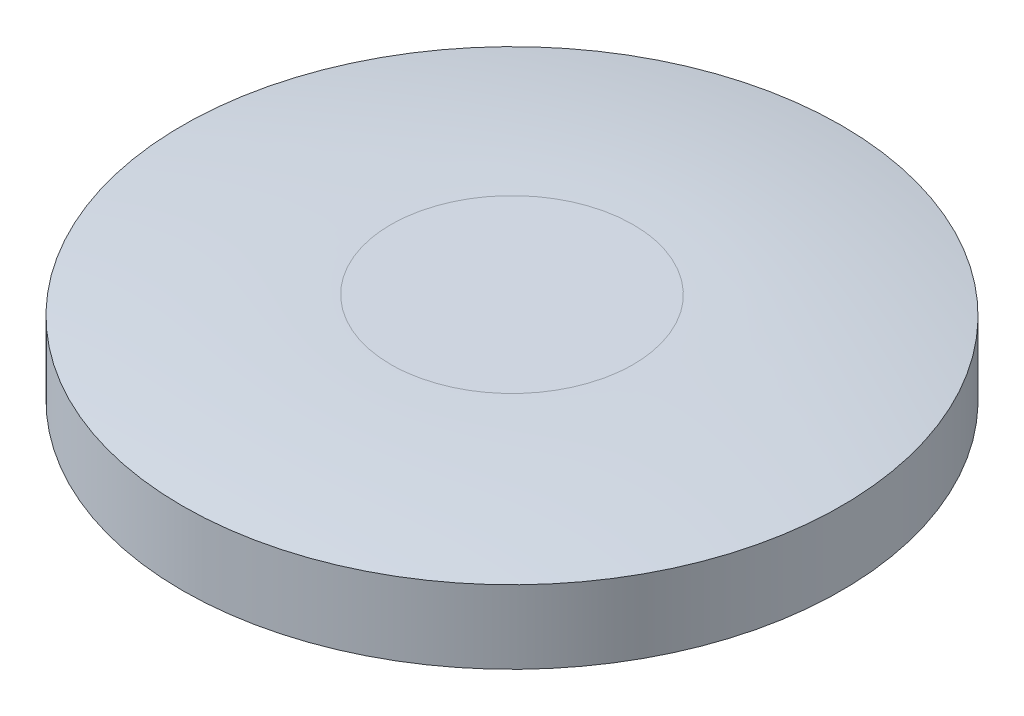
ISO-10303-21;
HEADER;
FILE_DESCRIPTION(('STEP AP214'),'2;1');
FILE_NAME('part.step','',(''),(''),'','','');
FILE_SCHEMA(('AUTOMOTIVE_DESIGN { 1 0 10303 214 1 1 1 1 }'));
ENDSEC;
DATA;
#1=APPLICATION_CONTEXT('core data for automotive mechanical design processes');
#2=APPLICATION_PROTOCOL_DEFINITION('international standard','automotive_design',2000,#1);
#3=PRODUCT_CONTEXT('',#1,'mechanical');
#4=PRODUCT('Part','Part','',(#3));
#5=PRODUCT_RELATED_PRODUCT_CATEGORY('part','',(#4));
#6=PRODUCT_DEFINITION_FORMATION('','',#4);
#7=PRODUCT_DEFINITION_CONTEXT('part definition',#1,'design');
#8=PRODUCT_DEFINITION('design','',#6,#7);
#9=PRODUCT_DEFINITION_SHAPE('','',#8);
#10=(LENGTH_UNIT() NAMED_UNIT(*) SI_UNIT(.MILLI.,.METRE.));
#11=(NAMED_UNIT(*) PLANE_ANGLE_UNIT() SI_UNIT($,.RADIAN.));
#12=(NAMED_UNIT(*) SI_UNIT($,.STERADIAN.) SOLID_ANGLE_UNIT());
#13=UNCERTAINTY_MEASURE_WITH_UNIT(LENGTH_MEASURE(1.E-05),#10,'distance_accuracy_value','');
#14=(GEOMETRIC_REPRESENTATION_CONTEXT(3) GLOBAL_UNCERTAINTY_ASSIGNED_CONTEXT((#13)) GLOBAL_UNIT_ASSIGNED_CONTEXT((#10,
#11,#12)) REPRESENTATION_CONTEXT('',''));
#15=CARTESIAN_POINT('',(0.,0.,0.));
#16=DIRECTION('',(0.,0.,1.));
#17=DIRECTION('',(1.,0.,0.));
#18=AXIS2_PLACEMENT_3D('',#15,#16,#17);
#19=CARTESIAN_POINT('',(0.,2.5,0.));
#20=DIRECTION('',(0.,1.,0.));
#21=DIRECTION('',(0.,0.,1.));
#22=AXIS2_PLACEMENT_3D('',#19,#20,#21);
#23=PLANE('',#22);
#24=CARTESIAN_POINT('',(-3.30895580666,2.49999999999977,0.));
#25=CARTESIAN_POINT('',(-3.30893733865203,2.49999999994382,-0.0594361078107856));
#26=CARTESIAN_POINT('',(-3.30733505503147,2.49999999998868,-0.118870390266973));
#27=CARTESIAN_POINT('',(-3.30097116644436,2.50000000001085,-0.237570616157456));
#28=CARTESIAN_POINT('',(-3.29620950593508,2.49999999998817,-0.296836556613857));
#29=CARTESIAN_POINT('',(-3.28353484144066,2.49999999960607,-0.415036416418897));
#30=CARTESIAN_POINT('',(-3.27562167175231,2.49999999924664,-0.473970318144007));
#31=CARTESIAN_POINT('',(-3.26141752296529,2.49999999765339,-0.561990217652563));
#32=CARTESIAN_POINT('',(-3.25629326947035,2.49999999694652,-0.591268871913185));
#33=CARTESIAN_POINT('',(-3.24525892157262,2.49999999534023,-0.649640376034052));
#34=CARTESIAN_POINT('',(-3.23934981149683,2.49999999444104,-0.678733411556944));
#35=CARTESIAN_POINT('',(-3.22040825368625,2.49999999237356,-0.765748635727406));
#36=CARTESIAN_POINT('',(-3.20616100467621,2.49999999183516,-0.823410529368299));
#37=CARTESIAN_POINT('',(-3.17453550496277,2.49999999298747,-0.9378671507964));
#38=CARTESIAN_POINT('',(-3.15715732214068,2.49999999467813,-0.994661897355141));
#39=CARTESIAN_POINT('',(-3.11915901064589,2.49999999793677,-1.10714788637597));
#40=CARTESIAN_POINT('',(-3.09853921691827,2.49999999950477,-1.16283924217911));
#41=CARTESIAN_POINT('',(-3.06102031229192,2.50000000035237,-1.25730917584845));
#42=CARTESIAN_POINT('',(-3.04475711288576,2.5000000001605,-1.29634461127523));
#43=CARTESIAN_POINT('',(-2.99919216657237,2.49999999952022,-1.40007596764891));
#44=CARTESIAN_POINT('',(-2.96853772142963,2.49999999898611,-1.46419094428458));
#45=CARTESIAN_POINT('',(-2.9273016999455,2.49999999731244,-1.54376873921371));
#46=CARTESIAN_POINT('',(-2.91859608309526,2.49999999691027,-1.56022801418134));
#47=CARTESIAN_POINT('',(-2.87850377741433,2.49999999503105,-1.63448856614067));
#48=CARTESIAN_POINT('',(-2.84550435444089,2.49999999341088,-1.69143948527397));
#49=CARTESIAN_POINT('',(-2.79622126903994,2.49999999215405,-1.7708301041527));
#50=CARTESIAN_POINT('',(-2.78132922872477,2.49999999191205,-1.79414885803792));
#51=CARTESIAN_POINT('',(-2.74848088876293,2.4999999917113,-1.84416529528064));
#52=CARTESIAN_POINT('',(-2.73042051009512,2.4999999918051,-1.87079482846359));
#53=CARTESIAN_POINT('',(-2.67507333060766,2.49999999239217,-1.949863379741));
#54=CARTESIAN_POINT('',(-2.63661628487179,2.49999999319109,-2.00148917613588));
#55=CARTESIAN_POINT('',(-2.5567477772561,2.4999999954059,-2.10239608593971));
#56=CARTESIAN_POINT('',(-2.51533647144942,2.49999999682176,-2.15167732298245));
#57=CARTESIAN_POINT('',(-2.429614115738,2.49999999900173,-2.24763981998017));
#58=CARTESIAN_POINT('',(-2.38530333041467,2.49999999976589,-2.29432131644737));
#59=CARTESIAN_POINT('',(-2.30860093215513,2.50000000015999,-2.37093193149955));
#60=CARTESIAN_POINT('',(-2.27685005516299,2.50000000007133,-2.40150723464606));
#61=CARTESIAN_POINT('',(-2.22194675834188,2.49999999978607,-2.45231954515312));
#62=CARTESIAN_POINT('',(-2.19909913217548,2.49999999963025,-2.47288573015193));
#63=CARTESIAN_POINT('',(-2.14701098317918,2.49999999897834,-2.5184853642004));
#64=CARTESIAN_POINT('',(-2.11761138693254,2.49999999840635,-2.54333735349956));
#65=CARTESIAN_POINT('',(-2.05297025626744,2.4999999968344,-2.59606710041674));
#66=CARTESIAN_POINT('',(-2.0175741036473,2.49999999577885,-2.62375565931932));
#67=CARTESIAN_POINT('',(-1.95003118781005,2.49999999392444,-2.67437975527825));
#68=CARTESIAN_POINT('',(-1.91801108072085,2.49999999310999,-2.6974844333635));
#69=CARTESIAN_POINT('',(-1.8628601882547,2.49999999220046,-2.73576850977486));
#70=CARTESIAN_POINT('',(-1.83993832050156,2.499999991963,-2.75124957542508));
#71=CARTESIAN_POINT('',(-1.78993361122691,2.49999999176525,-2.78410022306213));
#72=CARTESIAN_POINT('',(-1.76278233919079,2.49999999185652,-2.80136555692818));
#73=CARTESIAN_POINT('',(-1.68058480407873,2.49999999244148,-2.85194870699837));
#74=CARTESIAN_POINT('',(-1.62478825804121,2.49999999324628,-2.88405826478697));
#75=CARTESIAN_POINT('',(-1.51140734533203,2.49999999542206,-2.94493230343322));
#76=CARTESIAN_POINT('',(-1.45382307289224,2.49999999679301,-2.9736969602241));
#77=CARTESIAN_POINT('',(-1.33705506721513,2.49999999905639,-3.02776089943492));
#78=CARTESIAN_POINT('',(-1.27787147975118,2.49999999994886,-3.05306049641893));
#79=CARTESIAN_POINT('',(-1.1627189844855,2.50000000004679,-3.0983962125339));
#80=CARTESIAN_POINT('',(-1.10684980349366,2.49999999937589,-3.11868675890881));
#81=CARTESIAN_POINT('',(-0.994140040810346,2.49999999883155,-3.1563585747018));
#82=CARTESIAN_POINT('',(-0.937299484840892,2.49999999895808,-3.17373992102438));
#83=CARTESIAN_POINT('',(-0.822774979920826,2.50000000016306,-3.2054771077973));
#84=CARTESIAN_POINT('',(-0.76509097080715,2.50000000124158,-3.21983273128755));
#85=CARTESIAN_POINT('',(-0.678084310824992,2.49999999829089,-3.23920506605898));
#86=CARTESIAN_POINT('',(-0.648999052060136,2.4999999965455,-3.24530282899091));
#87=CARTESIAN_POINT('',(-0.606979501942218,2.49999999534832,-3.25339884486299));
#88=CARTESIAN_POINT('',(-0.594119417620336,2.49999999515951,-3.25578096189621));
#89=CARTESIAN_POINT('',(-0.546897089539505,2.4999999948985,-3.26421644358555));
#90=CARTESIAN_POINT('',(-0.512444698879037,2.49999999554596,-3.26976670129956));
#91=CARTESIAN_POINT('',(-0.422990995880729,2.49999999706043,-3.28272578188041));
#92=CARTESIAN_POINT('',(-0.367865940149489,2.4999999978314,-3.28929742386362));
#93=CARTESIAN_POINT('',(-0.280643385826698,2.49999999883414,-3.29746832721747));
#94=CARTESIAN_POINT('',(-0.248629501353683,2.49999999915622,-3.29999600887208));
#95=CARTESIAN_POINT('',(-0.189848565208276,2.49999999958993,-3.30378118109388));
#96=CARTESIAN_POINT('',(-0.16309059108994,2.49999999972757,-3.30517969978497));
#97=CARTESIAN_POINT('',(-0.0909055542510438,2.49999999997265,-3.30808048260152));
#98=CARTESIAN_POINT('',(-0.0454532615067524,2.49999999999232,-3.30897684753881));
#99=CARTESIAN_POINT('',(0.0593493084427673,2.50000000000949,-3.30892833312862));
#100=CARTESIAN_POINT('',(0.118700268537446,2.49999999999837,-3.30733676609594));
#101=CARTESIAN_POINT('',(0.23722900637213,2.49999999998555,-3.3009512898458));
#102=CARTESIAN_POINT('',(0.296406784976314,2.49999999998384,-3.2961573966355));
#103=CARTESIAN_POINT('',(0.414419713089004,2.49999999998225,-3.28340225777147));
#104=CARTESIAN_POINT('',(0.473254863055518,2.49999999998237,-3.27544101635268));
#105=CARTESIAN_POINT('',(0.59041286264643,2.49999999998694,-3.25636835928678));
#106=CARTESIAN_POINT('',(0.648735711079678,2.49999999999138,-3.24525693631718));
#107=CARTESIAN_POINT('',(0.764699733641788,2.49999999999858,-3.2199179650982));
#108=CARTESIAN_POINT('',(0.822340903688053,2.50000000000134,-3.20569039819606));
#109=CARTESIAN_POINT('',(0.936780074340733,2.49999999999615,-3.17415783515456));
#110=CARTESIAN_POINT('',(0.993578066807322,2.49999999998821,-3.15685280932709));
#111=CARTESIAN_POINT('',(1.07237988803518,2.49999999995883,-3.13051082426522));
#112=CARTESIAN_POINT('',(1.09481440422849,2.49999999994835,-3.12274228501441));
#113=CARTESIAN_POINT('',(1.15339331007514,2.49999999991528,-3.10174945129326));
#114=CARTESIAN_POINT('',(1.18939810512786,2.49999999988922,-3.08813352049807));
#115=CARTESIAN_POINT('',(1.28474797995119,2.49999999980827,-3.05015964953649));
#116=CARTESIAN_POINT('',(1.34365431926255,2.49999999974574,-3.02469093272298));
#117=CARTESIAN_POINT('',(1.45988506885815,2.49999999959923,-2.97037289161795));
#118=CARTESIAN_POINT('',(1.51720945565262,2.49999999951525,-2.94152351716179));
#119=CARTESIAN_POINT('',(1.63008563203672,2.49999999932948,-2.88054030264851));
#120=CARTESIAN_POINT('',(1.68563739653015,2.49999999922768,-2.84840641611742));
#121=CARTESIAN_POINT('',(1.79477944676229,2.49999999900941,-2.78096316377428));
#122=CARTESIAN_POINT('',(1.84836970608511,2.49999999889293,-2.74565375521911));
#123=CARTESIAN_POINT('',(1.95340762948048,2.4999999986483,-2.67197873364137));
#124=CARTESIAN_POINT('',(2.00485526617685,2.49999999852015,-2.63361308158753));
#125=CARTESIAN_POINT('',(2.10543375586123,2.4999999982552,-2.55395531934601));
#126=CARTESIAN_POINT('',(2.15456458084594,2.4999999981184,-2.51266317380089));
#127=CARTESIAN_POINT('',(2.25034323968346,2.49999999783829,-2.42729204430503));
#128=CARTESIAN_POINT('',(2.29699104523671,2.49999999769497,-2.38321302860419));
#129=CARTESIAN_POINT('',(2.38764560022946,2.49999999740656,-2.29241722912629));
#130=CARTESIAN_POINT('',(2.43165232138922,2.49999999726146,-2.2457004171151));
#131=CARTESIAN_POINT('',(2.51687646369709,2.49999999696377,-2.14978700166352));
#132=CARTESIAN_POINT('',(2.55809385690132,2.49999999681118,-2.10059037338863));
#133=CARTESIAN_POINT('',(2.63590353406404,2.49999999653694,-2.00202920678547));
#134=CARTESIAN_POINT('',(2.67261804609274,2.49999999641424,-1.95276109403174));
#135=CARTESIAN_POINT('',(2.74324538482345,2.49999999622897,-1.85225524890908));
#136=CARTESIAN_POINT('',(2.77715819616921,2.4999999961664,-1.80101750574676));
#137=CARTESIAN_POINT('',(2.84207680113159,2.49999999609799,-1.69673233618446));
#138=CARTESIAN_POINT('',(2.87308258881891,2.49999999609215,-1.64368490609365));
#139=CARTESIAN_POINT('',(2.93209068342957,2.49999999613964,-1.53594513385944));
#140=CARTESIAN_POINT('',(2.96009299456207,2.49999999619298,-1.48125279402142));
#141=CARTESIAN_POINT('',(3.01300708277809,2.49999999635466,-1.37039331633352));
#142=CARTESIAN_POINT('',(3.03791887482687,2.499999996463,-1.31422618562664));
#143=CARTESIAN_POINT('',(3.08457449041206,2.49999999672725,-1.20059177786982));
#144=CARTESIAN_POINT('',(3.1063183401889,2.49999999688316,-1.14312451159362));
#145=CARTESIAN_POINT('',(3.14657050958169,2.49999999723091,-1.02706854964601));
#146=CARTESIAN_POINT('',(3.16507886713044,2.49999999742276,-0.968479867130986));
#147=CARTESIAN_POINT('',(3.19880258807221,2.49999999782686,-0.850363278105954));
#148=CARTESIAN_POINT('',(3.21401800140261,2.4999999980391,-0.790835385853711));
#149=CARTESIAN_POINT('',(3.24110857877641,2.49999999846445,-0.671025503426388));
#150=CARTESIAN_POINT('',(3.25298380496804,2.49999999867755,-0.610743527303751));
#151=CARTESIAN_POINT('',(3.27335736737823,2.49999999908104,-0.4896129589056));
#152=CARTESIAN_POINT('',(3.28185577804819,2.49999999927143,-0.428764379152734));
#153=CARTESIAN_POINT('',(3.29544883227196,2.49999999960219,-0.306689800939222));
#154=CARTESIAN_POINT('',(3.30054356258514,2.49999999974257,-0.245463812138838));
#155=CARTESIAN_POINT('',(3.30731582758352,2.499999999941,-0.122824942405782));
#156=CARTESIAN_POINT('',(3.30899346113387,2.49999999999905,-0.0614120669316966));
#157=CARTESIAN_POINT('',(3.30895580666,2.49999999999977,0.));
#158=B_SPLINE_CURVE_WITH_KNOTS('',3,(#24,#25,#26,#27,#28,#29,#30,#31,#32,#33,#34,#35,#36,#37,
#38,#39,#40,#41,#42,#43,#44,#45,#46,#47,#48,#49,#50,#51,#52,#53,#54,#55,#56,#57,#58,#59,#60,#61,
#62,#63,#64,#65,#66,#67,#68,#69,#70,#71,#72,#73,#74,#75,#76,#77,#78,#79,#80,#81,#82,#83,#84,#85,
#86,#87,#88,#89,#90,#91,#92,#93,#94,#95,#96,#97,#98,#99,#100,#101,#102,#103,#104,#105,#106,#107,
#108,#109,#110,#111,#112,#113,#114,#115,#116,#117,#118,#119,#120,#121,#122,#123,#124,#125,#126,
#127,#128,#129,#130,#131,#132,#133,#134,#135,#136,#137,#138,#139,#140,#141,#142,#143,#144,#145,
#146,#147,#148,#149,#150,#151,#152,#153,#154,#155,#156,#157),.UNSPECIFIED.,.F.,.F.,(4,2,2,2,2,2,
2,2,2,2,2,2,2,2,2,2,2,2,2,2,2,2,2,2,2,2,2,2,2,2,2,2,2,2,2,2,2,2,2,2,2,2,2,2,2,2,2,2,2,2,2,2,2,2,
2,2,2,2,2,2,2,2,2,2,2,2,4),(0.,0.178284680855935,0.356572496089045,0.534869686754528,
0.624031647136617,0.713082822798651,0.891174290823216,1.06926189813797,1.24733111632185,
1.37417802049818,1.58718864090567,1.64304840356755,1.84035505789569,1.92335430503,
2.01986983445755,2.21287688459543,2.40587374573935,2.59885302015445,2.73106146996276,
2.82327159052679,2.93873702290497,3.07351589718897,3.1919461181201,3.27491733347432,
3.371432795289,3.56443972254829,3.75743649354059,3.95041573232632,4.12865546026913,
4.30689047571399,4.48513826719481,4.57427998384639,4.61351530502805,4.71818747661837,
4.88465391651716,4.98098254165093,5.06135870069111,5.19770462204571,5.37573444593822,
5.55376337993692,5.731792075901,5.90982118568965,6.08785136116203,6.2658832541773,
6.33710383740026,6.45256124091919,6.6449752613071,6.83739213723568,7.02981173613005,
7.22223392541532,7.41465857251661,7.60708554485904,7.79951470986771,7.99194593496774,
8.18437908758424,8.36861491750453,8.55285175716302,8.73708897259119,8.92132592982053,
9.1055619948825,9.28979653380861,9.47402891263039,9.65825849737943,9.84248465408737,
10.026706748786,10.210924147507,10.3951362162824),.UNSPECIFIED.);
#159=CARTESIAN_POINT('',(-3.30895580666,2.49999999999977,0.));
#160=VERTEX_POINT('',#159);
#161=CARTESIAN_POINT('',(3.30895580666102,2.49999999999976,0.));
#162=VERTEX_POINT('',#161);
#163=EDGE_CURVE('E33',#160,#162,#158,.T.);
#164=ORIENTED_EDGE('',*,*,#163,.F.);
#165=CARTESIAN_POINT('',(3.30895580666,2.49999999999977,0.));
#166=CARTESIAN_POINT('',(3.30893733865203,2.49999999994382,0.0594361078107852));
#167=CARTESIAN_POINT('',(3.30733505503147,2.49999999998868,0.118870390266972));
#168=CARTESIAN_POINT('',(3.30097116644436,2.50000000001085,0.237570616157454));
#169=CARTESIAN_POINT('',(3.29620950593509,2.49999999998817,0.296836556613854));
#170=CARTESIAN_POINT('',(3.28353484144066,2.49999999960607,0.415036416418894));
#171=CARTESIAN_POINT('',(3.27562167175231,2.49999999924664,0.473970318144004));
#172=CARTESIAN_POINT('',(3.26141752296529,2.49999999765339,0.561990217652562));
#173=CARTESIAN_POINT('',(3.25629326947035,2.49999999694652,0.591268871913183));
#174=CARTESIAN_POINT('',(3.24525892157262,2.49999999534023,0.64964037603405));
#175=CARTESIAN_POINT('',(3.23934981149683,2.49999999444104,0.678733411556942));
#176=CARTESIAN_POINT('',(3.22040825368625,2.49999999237356,0.765748635727405));
#177=CARTESIAN_POINT('',(3.20616100467621,2.49999999183516,0.823410529368298));
#178=CARTESIAN_POINT('',(3.17453550496277,2.49999999298747,0.937867150796399));
#179=CARTESIAN_POINT('',(3.15715732214068,2.49999999467813,0.994661897355139));
#180=CARTESIAN_POINT('',(3.1191590106459,2.49999999793677,1.10714788637597));
#181=CARTESIAN_POINT('',(3.09853921691827,2.49999999950477,1.16283924217911));
#182=CARTESIAN_POINT('',(3.06102031229188,2.50000000035237,1.25730917584856));
#183=CARTESIAN_POINT('',(3.04475711288567,2.5000000001605,1.29634461127545));
#184=CARTESIAN_POINT('',(2.99919216657226,2.49999999952022,1.40007596764913));
#185=CARTESIAN_POINT('',(2.96853772142957,2.49999999898611,1.46419094428468));
#186=CARTESIAN_POINT('',(2.92730169994555,2.49999999731244,1.54376873921361));
#187=CARTESIAN_POINT('',(2.91859608309536,2.49999999691027,1.56022801418114));
#188=CARTESIAN_POINT('',(2.87850377741453,2.49999999503105,1.63448856614032));
#189=CARTESIAN_POINT('',(2.84550435444114,2.49999999341088,1.69143948527357));
#190=CARTESIAN_POINT('',(2.79622126904014,2.49999999215405,1.7708301041524));
#191=CARTESIAN_POINT('',(2.78132922872487,2.49999999191205,1.79414885803777));
#192=CARTESIAN_POINT('',(2.74848088876293,2.4999999917113,1.84416529528064));
#193=CARTESIAN_POINT('',(2.73042051009512,2.4999999918051,1.87079482846359));
#194=CARTESIAN_POINT('',(2.67507333060766,2.49999999239217,1.949863379741));
#195=CARTESIAN_POINT('',(2.63661628487179,2.49999999319109,2.00148917613588));
#196=CARTESIAN_POINT('',(2.5567477772561,2.4999999954059,2.10239608593971));
#197=CARTESIAN_POINT('',(2.51533647144942,2.49999999682176,2.15167732298245));
#198=CARTESIAN_POINT('',(2.429614115738,2.49999999900173,2.24763981998017));
#199=CARTESIAN_POINT('',(2.38530333041467,2.49999999976589,2.29432131644737));
#200=CARTESIAN_POINT('',(2.30860093215518,2.50000000015999,2.3709319314995));
#201=CARTESIAN_POINT('',(2.2768500551631,2.50000000007133,2.40150723464596));
#202=CARTESIAN_POINT('',(2.22194675834202,2.49999999978607,2.45231954515299));
#203=CARTESIAN_POINT('',(2.19909913217561,2.49999999963025,2.47288573015182));
#204=CARTESIAN_POINT('',(2.14701098317925,2.49999999897834,2.51848536420034));
#205=CARTESIAN_POINT('',(2.11761138693258,2.49999999840635,2.54333735349953));
#206=CARTESIAN_POINT('',(2.05297025626734,2.4999999968344,2.59606710041683));
#207=CARTESIAN_POINT('',(2.01757410364708,2.49999999577885,2.62375565931949));
#208=CARTESIAN_POINT('',(1.95003118780972,2.49999999392444,2.67437975527849));
#209=CARTESIAN_POINT('',(1.91801108072053,2.49999999310999,2.69748443336372));
#210=CARTESIAN_POINT('',(1.86286018825449,2.49999999220046,2.735768509775));
#211=CARTESIAN_POINT('',(1.83993832050146,2.499999991963,2.75124957542515));
#212=CARTESIAN_POINT('',(1.78993361122691,2.49999999176525,2.78410022306213));
#213=CARTESIAN_POINT('',(1.76278233919079,2.49999999185652,2.80136555692818));
#214=CARTESIAN_POINT('',(1.68058480407873,2.49999999244148,2.85194870699837));
#215=CARTESIAN_POINT('',(1.62478825804121,2.49999999324628,2.88405826478697));
#216=CARTESIAN_POINT('',(1.51140734533204,2.49999999542206,2.94493230343322));
#217=CARTESIAN_POINT('',(1.45382307289225,2.49999999679301,2.9736969602241));
#218=CARTESIAN_POINT('',(1.33705506721512,2.49999999905639,3.02776089943492));
#219=CARTESIAN_POINT('',(1.27787147975115,2.49999999994886,3.05306049641893));
#220=CARTESIAN_POINT('',(1.16271898448554,2.50000000004679,3.0983962125339));
#221=CARTESIAN_POINT('',(1.10684980349377,2.49999999937589,3.1186867589088));
#222=CARTESIAN_POINT('',(0.994140040810236,2.49999999883155,3.15635857470181));
#223=CARTESIAN_POINT('',(0.93729948484048,2.49999999895808,3.1737399210244));
#224=CARTESIAN_POINT('',(0.822774979921243,2.50000000016306,3.20547710779728));
#225=CARTESIAN_POINT('',(0.765090970808698,2.50000000124158,3.21983273128747));
#226=CARTESIAN_POINT('',(0.678084310824222,2.49999999829089,3.23920506605902));
#227=CARTESIAN_POINT('',(0.648999052057924,2.4999999965455,3.24530282899102));
#228=CARTESIAN_POINT('',(0.606979501943183,2.49999999534832,3.25339884486294));
#229=CARTESIAN_POINT('',(0.594119417622974,2.49999999515951,3.25578096189608));
#230=CARTESIAN_POINT('',(0.546897089532384,2.4999999948985,3.26421644358592));
#231=CARTESIAN_POINT('',(0.512444698833935,2.49999999554596,3.26976670130188));
#232=CARTESIAN_POINT('',(0.422990995952385,2.49999999706043,3.28272578187672));
#233=CARTESIAN_POINT('',(0.367865940502888,2.49999999783141,3.28929742384544));
#234=CARTESIAN_POINT('',(0.280640145986819,2.49999999883418,3.29746863071311));
#235=CARTESIAN_POINT('',(0.248623012930157,2.49999999915629,3.29999652114877));
#236=CARTESIAN_POINT('',(0.189837342460064,2.49999999959001,3.30378182382224));
#237=CARTESIAN_POINT('',(0.163077885940584,2.49999999972765,3.30518032267508));
#238=CARTESIAN_POINT('',(0.0908960876442125,2.49999999997267,3.30808066436434));
#239=CARTESIAN_POINT('',(0.0454485286454897,2.49999999999232,3.30897683638187));
#240=CARTESIAN_POINT('',(-0.059349308443802,2.50000000000949,3.30892834483698));
#241=CARTESIAN_POINT('',(-0.118700270391502,2.4999999999984,3.30733681174115));
#242=CARTESIAN_POINT('',(-0.237229012868694,2.49999999998562,3.30095138063307));
#243=CARTESIAN_POINT('',(-0.296406794259452,2.49999999998393,3.29615749857409));
#244=CARTESIAN_POINT('',(-0.414419728273416,2.49999999998238,3.28340237723033));
#245=CARTESIAN_POINT('',(-0.47325488135148,2.4999999999825,3.27544114215137));
#246=CARTESIAN_POINT('',(-0.590412885936436,2.49999999998705,3.25636848829829));
#247=CARTESIAN_POINT('',(-0.648735736251393,2.49999999999147,3.24525706219686));
#248=CARTESIAN_POINT('',(-0.764699760012038,2.49999999999862,3.21991807668368));
#249=CARTESIAN_POINT('',(-0.822340929379306,2.50000000000135,3.20569049863826));
#250=CARTESIAN_POINT('',(-0.936780094956365,2.4999999999961,3.17415790573913));
#251=CARTESIAN_POINT('',(-0.993578083037956,2.49999999998813,3.15685286123973));
#252=CARTESIAN_POINT('',(-1.07237989473205,2.49999999995879,3.13051084392715));
#253=CARTESIAN_POINT('',(-1.094814407634,2.49999999994833,3.12274229482992));
#254=CARTESIAN_POINT('',(-1.1533933041184,2.49999999991532,3.10174943553732));
#255=CARTESIAN_POINT('',(-1.18939809291982,2.49999999988931,3.08813348908262));
#256=CARTESIAN_POINT('',(-1.28474795063227,2.49999999980852,3.0501595803359));
#257=CARTESIAN_POINT('',(-1.34365427951345,2.49999999974612,3.02469084382649));
#258=CARTESIAN_POINT('',(-1.4598850086959,2.4999999995999,2.97037276953012));
#259=CARTESIAN_POINT('',(-1.51720938553529,2.49999999951608,2.94152338163811));
#260=CARTESIAN_POINT('',(-1.63008554362661,2.49999999933062,2.88054014654869));
#261=CARTESIAN_POINT('',(-1.68563729980383,2.49999999922899,2.84840625291713));
#262=CARTESIAN_POINT('',(-1.79477933597183,2.499999999011,2.78096299213055));
#263=CARTESIAN_POINT('',(-1.84836958955969,2.49999999889465,2.74565358225342));
#264=CARTESIAN_POINT('',(-1.95340750500083,2.49999999865022,2.67197856328756));
#265=CARTESIAN_POINT('',(-2.00485513948028,2.49999999852215,2.63361291517094));
#266=CARTESIAN_POINT('',(-2.10543362907817,2.49999999825727,2.55395516538877));
#267=CARTESIAN_POINT('',(-2.1545644561831,2.49999999812046,2.51266302835287));
#268=CARTESIAN_POINT('',(-2.25034312449603,2.49999999784024,2.42729191981004));
#269=CARTESIAN_POINT('',(-2.29699093737983,2.49999999769683,2.38321291652536));
#270=CARTESIAN_POINT('',(-2.3876455125798,2.4999999974081,2.29241714467365));
#271=CARTESIAN_POINT('',(-2.43165224657548,2.49999999726279,2.24570034783179));
#272=CARTESIAN_POINT('',(-2.5168764221399,2.49999999696453,2.14978696578297));
#273=CARTESIAN_POINT('',(-2.55809383570639,2.49999999681158,2.10059035568959));
#274=CARTESIAN_POINT('',(-2.63590355524832,2.49999999653656,2.0020292226004));
#275=CARTESIAN_POINT('',(-2.67261808916154,2.49999999641345,1.95276112516965));
#276=CARTESIAN_POINT('',(-2.74324546822345,2.49999999622744,1.85225530504202));
#277=CARTESIAN_POINT('',(-2.77715829795683,2.49999999616454,1.80101757151024));
#278=CARTESIAN_POINT('',(-2.84207693706423,2.49999999609554,1.69673241717179));
#279=CARTESIAN_POINT('',(-2.87308274045992,2.49999999608944,1.64368499264378));
#280=CARTESIAN_POINT('',(-2.93209086293982,2.49999999613652,1.53594522780184));
#281=CARTESIAN_POINT('',(-2.96009318619519,2.4999999961897,1.48125288977248));
#282=CARTESIAN_POINT('',(-3.01300729474301,2.49999999635117,1.37039341269069));
#283=CARTESIAN_POINT('',(-3.03791909497464,2.49999999645947,1.31422628076883));
#284=CARTESIAN_POINT('',(-3.08457472259166,2.49999999672372,1.20059186823952));
#285=CARTESIAN_POINT('',(-3.10631857620412,2.49999999687968,1.14312459840031));
#286=CARTESIAN_POINT('',(-3.14657074862775,2.49999999722763,1.02706862771681));
#287=CARTESIAN_POINT('',(-3.16507910537171,2.49999999741963,0.968479940028898));
#288=CARTESIAN_POINT('',(-3.19880281982974,2.49999999782409,0.85036333980392));
#289=CARTESIAN_POINT('',(-3.21401822749505,2.49999999803655,0.790835441528583));
#290=CARTESIAN_POINT('',(-3.24110878851751,2.49999999846237,0.671025546980961));
#291=CARTESIAN_POINT('',(-3.25298400405104,2.49999999867574,0.610743564767477));
#292=CARTESIAN_POINT('',(-3.27335754006299,2.49999999907974,0.489612984907842));
#293=CARTESIAN_POINT('',(-3.28185593503552,2.49999999927037,0.428764399791504));
#294=CARTESIAN_POINT('',(-3.29544895280698,2.4999999996016,0.3066898123716));
#295=CARTESIAN_POINT('',(-3.3005436624227,2.49999999974219,0.245463819734662));
#296=CARTESIAN_POINT('',(-3.30731588108885,2.49999999994091,0.122824944650488));
#297=CARTESIAN_POINT('',(-3.30899348907648,2.49999999999905,0.0614120676657791));
#298=CARTESIAN_POINT('',(-3.30895580666,2.49999999999977,0.));
#299=B_SPLINE_CURVE_WITH_KNOTS('',3,(#165,#166,#167,#168,#169,#170,#171,#172,#173,#174,#175,
#176,#177,#178,#179,#180,#181,#182,#183,#184,#185,#186,#187,#188,#189,#190,#191,#192,#193,#194,
#195,#196,#197,#198,#199,#200,#201,#202,#203,#204,#205,#206,#207,#208,#209,#210,#211,#212,#213,
#214,#215,#216,#217,#218,#219,#220,#221,#222,#223,#224,#225,#226,#227,#228,#229,#230,#231,#232,
#233,#234,#235,#236,#237,#238,#239,#240,#241,#242,#243,#244,#245,#246,#247,#248,#249,#250,#251,
#252,#253,#254,#255,#256,#257,#258,#259,#260,#261,#262,#263,#264,#265,#266,#267,#268,#269,#270,
#271,#272,#273,#274,#275,#276,#277,#278,#279,#280,#281,#282,#283,#284,#285,#286,#287,#288,#289,
#290,#291,#292,#293,#294,#295,#296,#297,#298),.UNSPECIFIED.,.F.,.F.,(4,2,2,2,2,2,2,2,2,2,2,2,2,
2,2,2,2,2,2,2,2,2,2,2,2,2,2,2,2,2,2,2,2,2,2,2,2,2,2,2,2,2,2,2,2,2,2,2,2,2,2,2,2,2,2,2,2,2,2,2,2,
2,2,2,2,2,4),(0.,0.178284680855933,0.35657249608904,0.534869686754527,0.624031647136615,
0.713082822798648,0.891174290823215,1.06926189813797,1.24733111632185,1.37417802049854,
1.58718864090567,1.64304840356722,1.84035505789514,1.92335430503,2.01986983445755,
2.21287688459543,2.40587374573935,2.59885302015445,2.73106146996254,2.82327159052664,
2.93873702290496,3.0735158971894,3.19194611812048,3.27491733347432,3.371432795289,
3.56443972254829,3.75743649354059,3.95041573232632,4.12865546026913,4.30689047571398,
4.48513826719481,4.57427998384639,4.61351530502808,4.71818747661841,4.88465391651716,
4.98099230243115,5.06137289790934,5.1977046235225,5.37573444924482,5.55376338807552,
5.73179209050853,5.90982120703773,6.08785138815702,6.26588328436027,6.33710386790222,
6.45256127054889,6.64497528609422,6.83739215379199,7.02981174212739,7.22223391958556,
7.41465855465167,7.60708551581086,7.79951467154829,7.99194589034911,8.18437904069848,
8.36861487276733,8.55285171845673,8.73708894302227,8.92132591171955,9.10556198980415,
9.28979654253168,9.4740289351578,9.65825853293821,9.84248470112866,10.026706804985,
10.2109242097632,10.3951362807192),.UNSPECIFIED.);
#300=EDGE_CURVE('E31',#162,#160,#299,.T.);
#301=ORIENTED_EDGE('',*,*,#300,.F.);
#302=EDGE_LOOP('',(#164,#301));
#303=FACE_BOUND('',#302,.T.);
#304=ADVANCED_FACE('F16',(#303),#23,.T.);
#305=CARTESIAN_POINT('',(0.,-30.1379840105395,0.));
#306=DIRECTION('',(0.,1.,0.));
#307=DIRECTION('',(0.,0.,1.));
#308=AXIS2_PLACEMENT_3D('',#305,#306,#307);
#309=DEGENERATE_TOROIDAL_SURFACE('',#308,3.30895580666397,32.6379840105393,.T.);
#310=ORIENTED_EDGE('',*,*,#163,.T.);
#311=ORIENTED_EDGE('',*,*,#300,.T.);
#312=EDGE_LOOP('',(#310,#311));
#313=FACE_BOUND('',#312,.T.);
#314=CARTESIAN_POINT('',(0.,2.,0.));
#315=DIRECTION('',(0.,1.,0.));
#316=DIRECTION('',(0.,0.,1.));
#317=AXIS2_PLACEMENT_3D('',#314,#315,#316);
#318=CIRCLE('',#317,9.);
#319=CARTESIAN_POINT('',(0.,2.,9.));
#320=VERTEX_POINT('',#319);
#321=EDGE_CURVE('E26',#320,#320,#318,.F.);
#322=ORIENTED_EDGE('',*,*,#321,.F.);
#323=EDGE_LOOP('',(#322));
#324=FACE_BOUND('',#323,.T.);
#325=ADVANCED_FACE('F18',(#313,#324),#309,.T.);
#326=CARTESIAN_POINT('',(0.,0.,0.));
#327=DIRECTION('',(0.,1.,0.));
#328=DIRECTION('',(0.,0.,1.));
#329=AXIS2_PLACEMENT_3D('',#326,#327,#328);
#330=CYLINDRICAL_SURFACE('',#329,9.);
#331=CARTESIAN_POINT('',(0.,0.,0.));
#332=DIRECTION('',(0.,1.,0.));
#333=DIRECTION('',(0.,0.,1.));
#334=AXIS2_PLACEMENT_3D('',#331,#332,#333);
#335=CIRCLE('',#334,9.);
#336=CARTESIAN_POINT('',(0.,0.,9.));
#337=VERTEX_POINT('',#336);
#338=EDGE_CURVE('E11',#337,#337,#335,.T.);
#339=ORIENTED_EDGE('',*,*,#338,.T.);
#340=EDGE_LOOP('',(#339));
#341=FACE_BOUND('',#340,.T.);
#342=ORIENTED_EDGE('',*,*,#321,.T.);
#343=EDGE_LOOP('',(#342));
#344=FACE_BOUND('',#343,.T.);
#345=ADVANCED_FACE('F55',(#341,#344),#330,.T.);
#346=CARTESIAN_POINT('',(0.,0.,0.));
#347=DIRECTION('',(0.,1.,0.));
#348=DIRECTION('',(0.,0.,1.));
#349=AXIS2_PLACEMENT_3D('',#346,#347,#348);
#350=PLANE('',#349);
#351=ORIENTED_EDGE('',*,*,#338,.F.);
#352=EDGE_LOOP('',(#351));
#353=FACE_BOUND('',#352,.T.);
#354=ADVANCED_FACE('F58',(#353),#350,.F.);
#355=CLOSED_SHELL('',(#304,#325,#345,#354));
#356=MANIFOLD_SOLID_BREP('B1',#355);
#357=ADVANCED_BREP_SHAPE_REPRESENTATION('',(#18,#356),#14);
#358=SHAPE_DEFINITION_REPRESENTATION(#9,#357);
ENDSEC;
END-ISO-10303-21;
